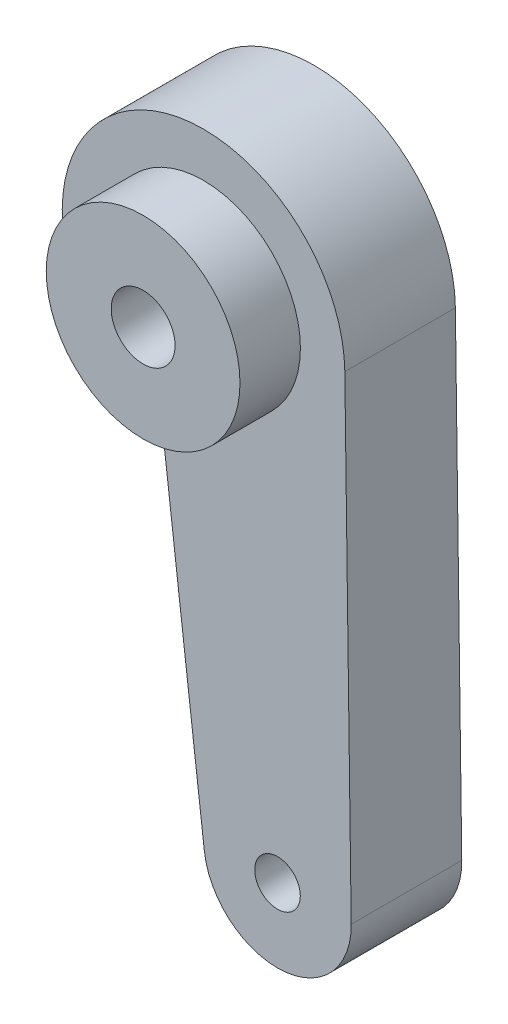
ISO-10303-21;
HEADER;
FILE_DESCRIPTION(('STEP AP214'),'2;1');
FILE_NAME('part.step','',(''),(''),'','','');
FILE_SCHEMA(('AUTOMOTIVE_DESIGN { 1 0 10303 214 1 1 1 1 }'));
ENDSEC;
DATA;
#1=APPLICATION_CONTEXT('core data for automotive mechanical design processes');
#2=APPLICATION_PROTOCOL_DEFINITION('international standard','automotive_design',2000,#1);
#3=PRODUCT_CONTEXT('',#1,'mechanical');
#4=PRODUCT('Part','Part','',(#3));
#5=PRODUCT_RELATED_PRODUCT_CATEGORY('part','',(#4));
#6=PRODUCT_DEFINITION_FORMATION('','',#4);
#7=PRODUCT_DEFINITION_CONTEXT('part definition',#1,'design');
#8=PRODUCT_DEFINITION('design','',#6,#7);
#9=PRODUCT_DEFINITION_SHAPE('','',#8);
#10=(LENGTH_UNIT() NAMED_UNIT(*) SI_UNIT(.MILLI.,.METRE.));
#11=(NAMED_UNIT(*) PLANE_ANGLE_UNIT() SI_UNIT($,.RADIAN.));
#12=(NAMED_UNIT(*) SI_UNIT($,.STERADIAN.) SOLID_ANGLE_UNIT());
#13=UNCERTAINTY_MEASURE_WITH_UNIT(LENGTH_MEASURE(1.E-05),#10,'distance_accuracy_value','');
#14=(GEOMETRIC_REPRESENTATION_CONTEXT(3) GLOBAL_UNCERTAINTY_ASSIGNED_CONTEXT((#13)) GLOBAL_UNIT_ASSIGNED_CONTEXT((#10,
#11,#12)) REPRESENTATION_CONTEXT('',''));
#15=CARTESIAN_POINT('',(0.,0.,0.));
#16=DIRECTION('',(0.,0.,1.));
#17=DIRECTION('',(1.,0.,0.));
#18=AXIS2_PLACEMENT_3D('',#15,#16,#17);
#19=CARTESIAN_POINT('',(0.,0.,9.7));
#20=DIRECTION('',(0.,0.,1.));
#21=DIRECTION('',(1.,0.,0.));
#22=AXIS2_PLACEMENT_3D('',#19,#20,#21);
#23=PLANE('',#22);
#24=CARTESIAN_POINT('',(6.4916675213737,-41.6342822584795,9.7));
#25=DIRECTION('',(0.,0.,1.));
#26=DIRECTION('',(1.,0.,0.));
#27=AXIS2_PLACEMENT_3D('',#24,#25,#26);
#28=CIRCLE('',#27,2.);
#29=CARTESIAN_POINT('',(8.4916675213737,-41.6342822584795,9.7));
#30=VERTEX_POINT('',#29);
#31=EDGE_CURVE('E113',#30,#30,#28,.T.);
#32=ORIENTED_EDGE('',*,*,#31,.F.);
#33=EDGE_LOOP('',(#32));
#34=FACE_BOUND('',#33,.T.);
#35=CARTESIAN_POINT('',(0.,0.,9.7));
#36=DIRECTION('',(0.,0.,1.));
#37=DIRECTION('',(1.,0.,0.));
#38=AXIS2_PLACEMENT_3D('',#35,#36,#37);
#39=CIRCLE('',#38,12.3990852198062);
#40=CARTESIAN_POINT('',(12.3979687230407,0.166390596252107,9.7));
#41=VERTEX_POINT('',#40);
#42=CARTESIAN_POINT('',(-3.63145766867051,-11.8553713349127,9.7));
#43=VERTEX_POINT('',#42);
#44=EDGE_CURVE('E84',#41,#43,#39,.T.);
#45=ORIENTED_EDGE('',*,*,#44,.T.);
#46=DIRECTION('',(0.120315698833244,-0.992735681142905,0.));
#47=VECTOR('',#46,1.);
#48=CARTESIAN_POINT('',(-3.63145766867051,-11.8553713349127,9.7));
#49=LINE('',#48,#47);
#50=CARTESIAN_POINT('',(0.0719267137938434,-42.4123298458323,9.7));
#51=VERTEX_POINT('',#50);
#52=EDGE_CURVE('E79',#43,#51,#49,.T.);
#53=ORIENTED_EDGE('',*,*,#52,.T.);
#54=CARTESIAN_POINT('',(6.4916675213737,-41.6342822584795,9.7));
#55=DIRECTION('',(0.,0.,1.));
#56=DIRECTION('',(1.,0.,0.));
#57=AXIS2_PLACEMENT_3D('',#54,#55,#56);
#58=CIRCLE('',#57,6.46671710257156);
#59=CARTESIAN_POINT('',(12.9578023173799,-41.5475015891466,9.7));
#60=VERTEX_POINT('',#59);
#61=EDGE_CURVE('E82',#51,#60,#58,.T.);
#62=ORIENTED_EDGE('',*,*,#61,.T.);
#63=DIRECTION('',(-0.013419586469679,0.999909953295287,0.));
#64=VECTOR('',#63,1.);
#65=CARTESIAN_POINT('',(12.3979687230407,0.166390596252107,9.7));
#66=LINE('',#65,#64);
#67=EDGE_CURVE('E49',#60,#41,#66,.T.);
#68=ORIENTED_EDGE('',*,*,#67,.T.);
#69=EDGE_LOOP('',(#45,#53,#62,#68));
#70=FACE_BOUND('',#69,.T.);
#71=CARTESIAN_POINT('',(0.,0.,9.7));
#72=DIRECTION('',(0.,0.,1.));
#73=DIRECTION('',(1.,0.,0.));
#74=AXIS2_PLACEMENT_3D('',#71,#72,#73);
#75=CIRCLE('',#74,8.5);
#76=CARTESIAN_POINT('',(8.5,0.,9.7));
#77=VERTEX_POINT('',#76);
#78=EDGE_CURVE('E123',#77,#77,#75,.T.);
#79=ORIENTED_EDGE('',*,*,#78,.F.);
#80=EDGE_LOOP('',(#79));
#81=FACE_BOUND('',#80,.T.);
#82=ADVANCED_FACE('F32',(#34,#70,#81),#23,.T.);
#83=CARTESIAN_POINT('',(0.,0.,0.));
#84=DIRECTION('',(0.,0.,1.));
#85=DIRECTION('',(1.,0.,0.));
#86=AXIS2_PLACEMENT_3D('',#83,#84,#85);
#87=PLANE('',#86);
#88=CARTESIAN_POINT('',(0.,0.,0.));
#89=DIRECTION('',(0.,0.,1.));
#90=DIRECTION('',(1.,0.,0.));
#91=AXIS2_PLACEMENT_3D('',#88,#89,#90);
#92=CIRCLE('',#91,5.5);
#93=CARTESIAN_POINT('',(5.5,0.,0.));
#94=VERTEX_POINT('',#93);
#95=EDGE_CURVE('E99',#94,#94,#92,.T.);
#96=ORIENTED_EDGE('',*,*,#95,.T.);
#97=EDGE_LOOP('',(#96));
#98=FACE_BOUND('',#97,.T.);
#99=CARTESIAN_POINT('',(0.,0.,0.));
#100=DIRECTION('',(0.,0.,1.));
#101=DIRECTION('',(1.,0.,0.));
#102=AXIS2_PLACEMENT_3D('',#99,#100,#101);
#103=CIRCLE('',#102,12.3990852198062);
#104=CARTESIAN_POINT('',(12.3979687230407,0.166390596252107,0.));
#105=VERTEX_POINT('',#104);
#106=CARTESIAN_POINT('',(-3.63145766867051,-11.8553713349127,0.));
#107=VERTEX_POINT('',#106);
#108=EDGE_CURVE('E96',#105,#107,#103,.T.);
#109=ORIENTED_EDGE('',*,*,#108,.F.);
#110=DIRECTION('',(-0.013419586469679,0.999909953295287,0.));
#111=VECTOR('',#110,1.);
#112=CARTESIAN_POINT('',(12.3979687230407,0.166390596252107,0.));
#113=LINE('',#112,#111);
#114=CARTESIAN_POINT('',(12.9578023173799,-41.5475015891466,0.));
#115=VERTEX_POINT('',#114);
#116=EDGE_CURVE('E72',#115,#105,#113,.T.);
#117=ORIENTED_EDGE('',*,*,#116,.F.);
#118=CARTESIAN_POINT('',(6.4916675213737,-41.6342822584795,0.));
#119=DIRECTION('',(0.,0.,1.));
#120=DIRECTION('',(1.,0.,0.));
#121=AXIS2_PLACEMENT_3D('',#118,#119,#120);
#122=CIRCLE('',#121,6.46671710257156);
#123=CARTESIAN_POINT('',(0.0719267137938434,-42.4123298458323,0.));
#124=VERTEX_POINT('',#123);
#125=EDGE_CURVE('E66',#124,#115,#122,.T.);
#126=ORIENTED_EDGE('',*,*,#125,.F.);
#127=DIRECTION('',(0.120315698833244,-0.992735681142905,0.));
#128=VECTOR('',#127,1.);
#129=CARTESIAN_POINT('',(-3.63145766867051,-11.8553713349127,0.));
#130=LINE('',#129,#128);
#131=EDGE_CURVE('E88',#107,#124,#130,.T.);
#132=ORIENTED_EDGE('',*,*,#131,.F.);
#133=EDGE_LOOP('',(#109,#117,#126,#132));
#134=FACE_BOUND('',#133,.T.);
#135=CARTESIAN_POINT('',(6.4916675213737,-41.6342822584795,0.));
#136=DIRECTION('',(0.,0.,1.));
#137=DIRECTION('',(1.,0.,0.));
#138=AXIS2_PLACEMENT_3D('',#135,#136,#137);
#139=CIRCLE('',#138,2.);
#140=CARTESIAN_POINT('',(8.4916675213737,-41.6342822584795,0.));
#141=VERTEX_POINT('',#140);
#142=EDGE_CURVE('E114',#141,#141,#139,.T.);
#143=ORIENTED_EDGE('',*,*,#142,.T.);
#144=EDGE_LOOP('',(#143));
#145=FACE_BOUND('',#144,.T.);
#146=ADVANCED_FACE('F107',(#98,#134,#145),#87,.F.);
#147=CARTESIAN_POINT('',(0.,0.,9.7));
#148=DIRECTION('',(0.,0.,-1.));
#149=DIRECTION('',(-1.,0.,0.));
#150=AXIS2_PLACEMENT_3D('',#147,#148,#149);
#151=CYLINDRICAL_SURFACE('',#150,12.3990852198062);
#152=ORIENTED_EDGE('',*,*,#108,.T.);
#153=DIRECTION('',(0.,0.,-1.));
#154=VECTOR('',#153,1.);
#155=CARTESIAN_POINT('',(-3.63145766867051,-11.8553713349127,9.7));
#156=LINE('',#155,#154);
#157=EDGE_CURVE('E11',#43,#107,#156,.T.);
#158=ORIENTED_EDGE('',*,*,#157,.F.);
#159=ORIENTED_EDGE('',*,*,#44,.F.);
#160=DIRECTION('',(0.,0.,-1.));
#161=VECTOR('',#160,1.);
#162=CARTESIAN_POINT('',(12.3979687230407,0.166390596252107,9.7));
#163=LINE('',#162,#161);
#164=EDGE_CURVE('E92',#41,#105,#163,.T.);
#165=ORIENTED_EDGE('',*,*,#164,.T.);
#166=EDGE_LOOP('',(#152,#158,#159,#165));
#167=FACE_BOUND('',#166,.T.);
#168=ADVANCED_FACE('F34',(#167),#151,.T.);
#169=CARTESIAN_POINT('',(-3.63145766867051,-11.8553713349127,9.7));
#170=DIRECTION('',(0.992735681142905,0.120315698833244,0.));
#171=DIRECTION('',(-0.120315698833244,0.992735681142905,0.));
#172=AXIS2_PLACEMENT_3D('',#169,#170,#171);
#173=PLANE('',#172);
#174=ORIENTED_EDGE('',*,*,#131,.T.);
#175=DIRECTION('',(0.,0.,-1.));
#176=VECTOR('',#175,1.);
#177=CARTESIAN_POINT('',(0.0719267137938434,-42.4123298458323,9.7));
#178=LINE('',#177,#176);
#179=EDGE_CURVE('E41',#51,#124,#178,.T.);
#180=ORIENTED_EDGE('',*,*,#179,.F.);
#181=ORIENTED_EDGE('',*,*,#52,.F.);
#182=ORIENTED_EDGE('',*,*,#157,.T.);
#183=EDGE_LOOP('',(#174,#180,#181,#182));
#184=FACE_BOUND('',#183,.T.);
#185=ADVANCED_FACE('F87',(#184),#173,.F.);
#186=CARTESIAN_POINT('',(6.4916675213737,-41.6342822584795,9.7));
#187=DIRECTION('',(0.,0.,-1.));
#188=DIRECTION('',(-1.,0.,0.));
#189=AXIS2_PLACEMENT_3D('',#186,#187,#188);
#190=CYLINDRICAL_SURFACE('',#189,6.46671710257156);
#191=ORIENTED_EDGE('',*,*,#125,.T.);
#192=DIRECTION('',(0.,0.,-1.));
#193=VECTOR('',#192,1.);
#194=CARTESIAN_POINT('',(12.9578023173799,-41.5475015891466,9.7));
#195=LINE('',#194,#193);
#196=EDGE_CURVE('E89',#60,#115,#195,.T.);
#197=ORIENTED_EDGE('',*,*,#196,.F.);
#198=ORIENTED_EDGE('',*,*,#61,.F.);
#199=ORIENTED_EDGE('',*,*,#179,.T.);
#200=EDGE_LOOP('',(#191,#197,#198,#199));
#201=FACE_BOUND('',#200,.T.);
#202=ADVANCED_FACE('F90',(#201),#190,.T.);
#203=CARTESIAN_POINT('',(12.3979687230407,0.166390596252107,9.7));
#204=DIRECTION('',(-0.999909953295287,-0.013419586469679,0.));
#205=DIRECTION('',(0.013419586469679,-0.999909953295287,0.));
#206=AXIS2_PLACEMENT_3D('',#203,#204,#205);
#207=PLANE('',#206);
#208=ORIENTED_EDGE('',*,*,#116,.T.);
#209=ORIENTED_EDGE('',*,*,#164,.F.);
#210=ORIENTED_EDGE('',*,*,#67,.F.);
#211=ORIENTED_EDGE('',*,*,#196,.T.);
#212=EDGE_LOOP('',(#208,#209,#210,#211));
#213=FACE_BOUND('',#212,.T.);
#214=ADVANCED_FACE('F104',(#213),#207,.F.);
#215=CARTESIAN_POINT('',(0.,0.,9.7));
#216=DIRECTION('',(0.,0.,-1.));
#217=DIRECTION('',(-1.,0.,0.));
#218=AXIS2_PLACEMENT_3D('',#215,#216,#217);
#219=CYLINDRICAL_SURFACE('',#218,5.5);
#220=CARTESIAN_POINT('',(0.,0.,9.7));
#221=DIRECTION('',(0.,0.,1.));
#222=DIRECTION('',(1.,0.,0.));
#223=AXIS2_PLACEMENT_3D('',#220,#221,#222);
#224=CIRCLE('',#223,5.5);
#225=CARTESIAN_POINT('',(5.5,0.,9.7));
#226=VERTEX_POINT('',#225);
#227=EDGE_CURVE('E117',#226,#226,#224,.T.);
#228=ORIENTED_EDGE('',*,*,#227,.T.);
#229=EDGE_LOOP('',(#228));
#230=FACE_BOUND('',#229,.T.);
#231=ORIENTED_EDGE('',*,*,#95,.F.);
#232=EDGE_LOOP('',(#231));
#233=FACE_BOUND('',#232,.T.);
#234=ADVANCED_FACE('F151',(#230,#233),#219,.F.);
#235=CARTESIAN_POINT('',(6.4916675213737,-41.6342822584795,9.7));
#236=DIRECTION('',(0.,0.,-1.));
#237=DIRECTION('',(-1.,0.,0.));
#238=AXIS2_PLACEMENT_3D('',#235,#236,#237);
#239=CYLINDRICAL_SURFACE('',#238,2.);
#240=ORIENTED_EDGE('',*,*,#31,.T.);
#241=EDGE_LOOP('',(#240));
#242=FACE_BOUND('',#241,.T.);
#243=ORIENTED_EDGE('',*,*,#142,.F.);
#244=EDGE_LOOP('',(#243));
#245=FACE_BOUND('',#244,.T.);
#246=ADVANCED_FACE('F141',(#242,#245),#239,.F.);
#247=CARTESIAN_POINT('',(0.,0.,15.));
#248=DIRECTION('',(0.,0.,1.));
#249=DIRECTION('',(1.,0.,0.));
#250=AXIS2_PLACEMENT_3D('',#247,#248,#249);
#251=PLANE('',#250);
#252=CARTESIAN_POINT('',(0.,0.,15.));
#253=DIRECTION('',(0.,0.,1.));
#254=DIRECTION('',(1.,0.,0.));
#255=AXIS2_PLACEMENT_3D('',#252,#253,#254);
#256=CIRCLE('',#255,8.5);
#257=CARTESIAN_POINT('',(8.5,0.,15.));
#258=VERTEX_POINT('',#257);
#259=EDGE_CURVE('E122',#258,#258,#256,.T.);
#260=ORIENTED_EDGE('',*,*,#259,.T.);
#261=EDGE_LOOP('',(#260));
#262=FACE_BOUND('',#261,.T.);
#263=CARTESIAN_POINT('',(0.,0.,15.));
#264=DIRECTION('',(0.,0.,1.));
#265=DIRECTION('',(1.,0.,0.));
#266=AXIS2_PLACEMENT_3D('',#263,#264,#265);
#267=CIRCLE('',#266,2.8);
#268=CARTESIAN_POINT('',(2.8,0.,15.));
#269=VERTEX_POINT('',#268);
#270=EDGE_CURVE('E126',#269,#269,#267,.T.);
#271=ORIENTED_EDGE('',*,*,#270,.F.);
#272=EDGE_LOOP('',(#271));
#273=FACE_BOUND('',#272,.T.);
#274=ADVANCED_FACE('F138',(#262,#273),#251,.T.);
#275=CARTESIAN_POINT('',(0.,0.,9.7));
#276=DIRECTION('',(0.,0.,1.));
#277=DIRECTION('',(1.,0.,0.));
#278=AXIS2_PLACEMENT_3D('',#275,#276,#277);
#279=PLANE('',#278);
#280=ORIENTED_EDGE('',*,*,#227,.F.);
#281=EDGE_LOOP('',(#280));
#282=FACE_BOUND('',#281,.T.);
#283=CARTESIAN_POINT('',(0.,0.,9.7));
#284=DIRECTION('',(0.,0.,1.));
#285=DIRECTION('',(1.,0.,0.));
#286=AXIS2_PLACEMENT_3D('',#283,#284,#285);
#287=CIRCLE('',#286,2.8);
#288=CARTESIAN_POINT('',(2.8,0.,9.7));
#289=VERTEX_POINT('',#288);
#290=EDGE_CURVE('E129',#289,#289,#287,.T.);
#291=ORIENTED_EDGE('',*,*,#290,.T.);
#292=EDGE_LOOP('',(#291));
#293=FACE_BOUND('',#292,.T.);
#294=ADVANCED_FACE('F140',(#282,#293),#279,.F.);
#295=CARTESIAN_POINT('',(0.,0.,15.));
#296=DIRECTION('',(0.,0.,-1.));
#297=DIRECTION('',(-1.,0.,0.));
#298=AXIS2_PLACEMENT_3D('',#295,#296,#297);
#299=CYLINDRICAL_SURFACE('',#298,8.5);
#300=ORIENTED_EDGE('',*,*,#259,.F.);
#301=EDGE_LOOP('',(#300));
#302=FACE_BOUND('',#301,.T.);
#303=ORIENTED_EDGE('',*,*,#78,.T.);
#304=EDGE_LOOP('',(#303));
#305=FACE_BOUND('',#304,.T.);
#306=ADVANCED_FACE('F148',(#302,#305),#299,.T.);
#307=CARTESIAN_POINT('',(0.,0.,15.));
#308=DIRECTION('',(0.,0.,-1.));
#309=DIRECTION('',(-1.,0.,0.));
#310=AXIS2_PLACEMENT_3D('',#307,#308,#309);
#311=CYLINDRICAL_SURFACE('',#310,2.8);
#312=ORIENTED_EDGE('',*,*,#270,.T.);
#313=EDGE_LOOP('',(#312));
#314=FACE_BOUND('',#313,.T.);
#315=ORIENTED_EDGE('',*,*,#290,.F.);
#316=EDGE_LOOP('',(#315));
#317=FACE_BOUND('',#316,.T.);
#318=ADVANCED_FACE('F135',(#314,#317),#311,.F.);
#319=CLOSED_SHELL('',(#82,#146,#168,#185,#202,#214,#234,#246,#274,#294,#306,#318));
#320=MANIFOLD_SOLID_BREP('B2',#319);
#321=ADVANCED_BREP_SHAPE_REPRESENTATION('',(#18,#320),#14);
#322=SHAPE_DEFINITION_REPRESENTATION(#9,#321);
ENDSEC;
END-ISO-10303-21;
